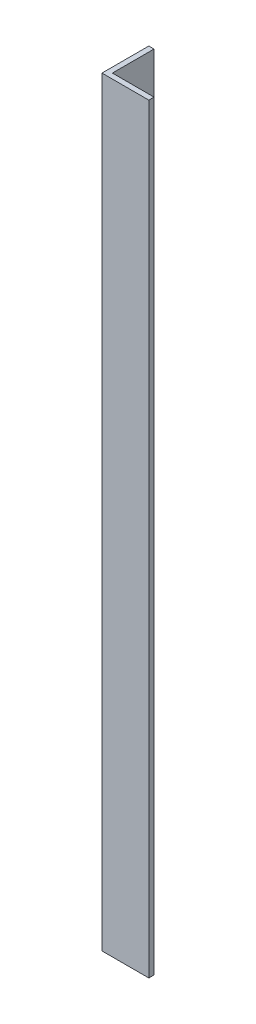
ISO-10303-21;
HEADER;
FILE_DESCRIPTION(('STEP AP214'),'2;1');
FILE_NAME('part.step','',(''),(''),'','','');
FILE_SCHEMA(('AUTOMOTIVE_DESIGN { 1 0 10303 214 1 1 1 1 }'));
ENDSEC;
DATA;
#1=APPLICATION_CONTEXT('core data for automotive mechanical design processes');
#2=APPLICATION_PROTOCOL_DEFINITION('international standard','automotive_design',2000,#1);
#3=PRODUCT_CONTEXT('',#1,'mechanical');
#4=PRODUCT('Part','Part','',(#3));
#5=PRODUCT_RELATED_PRODUCT_CATEGORY('part','',(#4));
#6=PRODUCT_DEFINITION_FORMATION('','',#4);
#7=PRODUCT_DEFINITION_CONTEXT('part definition',#1,'design');
#8=PRODUCT_DEFINITION('design','',#6,#7);
#9=PRODUCT_DEFINITION_SHAPE('','',#8);
#10=(LENGTH_UNIT() NAMED_UNIT(*) SI_UNIT(.MILLI.,.METRE.));
#11=(NAMED_UNIT(*) PLANE_ANGLE_UNIT() SI_UNIT($,.RADIAN.));
#12=(NAMED_UNIT(*) SI_UNIT($,.STERADIAN.) SOLID_ANGLE_UNIT());
#13=UNCERTAINTY_MEASURE_WITH_UNIT(LENGTH_MEASURE(1.E-05),#10,'distance_accuracy_value','');
#14=(GEOMETRIC_REPRESENTATION_CONTEXT(3) GLOBAL_UNCERTAINTY_ASSIGNED_CONTEXT((#13)) GLOBAL_UNIT_ASSIGNED_CONTEXT((#10,
#11,#12)) REPRESENTATION_CONTEXT('',''));
#15=CARTESIAN_POINT('',(0.,0.,0.));
#16=DIRECTION('',(0.,0.,1.));
#17=DIRECTION('',(1.,0.,0.));
#18=AXIS2_PLACEMENT_3D('',#15,#16,#17);
#19=CARTESIAN_POINT('',(0.,730.,0.));
#20=DIRECTION('',(0.,0.,-1.));
#21=DIRECTION('',(-1.,0.,0.));
#22=AXIS2_PLACEMENT_3D('',#19,#20,#21);
#23=PLANE('',#22);
#24=DIRECTION('',(1.,0.,0.));
#25=VECTOR('',#24,1.);
#26=CARTESIAN_POINT('',(0.,0.,0.));
#27=LINE('',#26,#25);
#28=CARTESIAN_POINT('',(0.,0.,0.));
#29=VERTEX_POINT('',#28);
#30=CARTESIAN_POINT('',(45.,0.,0.));
#31=VERTEX_POINT('',#30);
#32=EDGE_CURVE('E138',#29,#31,#27,.T.);
#33=ORIENTED_EDGE('',*,*,#32,.T.);
#34=DIRECTION('',(0.,-1.,0.));
#35=VECTOR('',#34,1.);
#36=CARTESIAN_POINT('',(45.,730.,0.));
#37=LINE('',#36,#35);
#38=CARTESIAN_POINT('',(45.,730.,0.));
#39=VERTEX_POINT('',#38);
#40=EDGE_CURVE('E11',#39,#31,#37,.T.);
#41=ORIENTED_EDGE('',*,*,#40,.F.);
#42=DIRECTION('',(1.,0.,0.));
#43=VECTOR('',#42,1.);
#44=CARTESIAN_POINT('',(0.,730.,0.));
#45=LINE('',#44,#43);
#46=CARTESIAN_POINT('',(0.,730.,0.));
#47=VERTEX_POINT('',#46);
#48=EDGE_CURVE('E97',#47,#39,#45,.T.);
#49=ORIENTED_EDGE('',*,*,#48,.F.);
#50=DIRECTION('',(0.,-1.,0.));
#51=VECTOR('',#50,1.);
#52=CARTESIAN_POINT('',(0.,730.,0.));
#53=LINE('',#52,#51);
#54=EDGE_CURVE('E134',#47,#29,#53,.T.);
#55=ORIENTED_EDGE('',*,*,#54,.T.);
#56=EDGE_LOOP('',(#33,#41,#49,#55));
#57=FACE_BOUND('',#56,.T.);
#58=ADVANCED_FACE('F38',(#57),#23,.F.);
#59=CARTESIAN_POINT('',(45.,730.,-5.));
#60=DIRECTION('',(1.,0.,0.));
#61=DIRECTION('',(0.,0.,-1.));
#62=AXIS2_PLACEMENT_3D('',#59,#60,#61);
#63=PLANE('',#62);
#64=DIRECTION('',(0.,0.,1.));
#65=VECTOR('',#64,1.);
#66=CARTESIAN_POINT('',(45.,0.,-5.));
#67=LINE('',#66,#65);
#68=CARTESIAN_POINT('',(45.,0.,-5.));
#69=VERTEX_POINT('',#68);
#70=EDGE_CURVE('E141',#69,#31,#67,.T.);
#71=ORIENTED_EDGE('',*,*,#70,.F.);
#72=DIRECTION('',(0.,-1.,0.));
#73=VECTOR('',#72,1.);
#74=CARTESIAN_POINT('',(45.,730.,-5.));
#75=LINE('',#74,#73);
#76=CARTESIAN_POINT('',(45.,730.,-5.));
#77=VERTEX_POINT('',#76);
#78=EDGE_CURVE('E47',#77,#69,#75,.T.);
#79=ORIENTED_EDGE('',*,*,#78,.F.);
#80=DIRECTION('',(0.,0.,1.));
#81=VECTOR('',#80,1.);
#82=CARTESIAN_POINT('',(45.,730.,-5.));
#83=LINE('',#82,#81);
#84=EDGE_CURVE('E242',#77,#39,#83,.T.);
#85=ORIENTED_EDGE('',*,*,#84,.T.);
#86=ORIENTED_EDGE('',*,*,#40,.T.);
#87=EDGE_LOOP('',(#71,#79,#85,#86));
#88=FACE_BOUND('',#87,.T.);
#89=ADVANCED_FACE('F168',(#88),#63,.T.);
#90=CARTESIAN_POINT('',(0.,730.,-5.));
#91=DIRECTION('',(0.,0.,-1.));
#92=DIRECTION('',(-1.,0.,0.));
#93=AXIS2_PLACEMENT_3D('',#90,#91,#92);
#94=PLANE('',#93);
#95=DIRECTION('',(1.,0.,0.));
#96=VECTOR('',#95,1.);
#97=CARTESIAN_POINT('',(0.,0.,-5.));
#98=LINE('',#97,#96);
#99=CARTESIAN_POINT('',(5.,0.,-5.));
#100=VERTEX_POINT('',#99);
#101=EDGE_CURVE('E145',#100,#69,#98,.T.);
#102=ORIENTED_EDGE('',*,*,#101,.F.);
#103=DIRECTION('',(0.,-1.,0.));
#104=VECTOR('',#103,1.);
#105=CARTESIAN_POINT('',(5.,730.,-5.));
#106=LINE('',#105,#104);
#107=CARTESIAN_POINT('',(5.,730.,-5.));
#108=VERTEX_POINT('',#107);
#109=EDGE_CURVE('E119',#108,#100,#106,.T.);
#110=ORIENTED_EDGE('',*,*,#109,.F.);
#111=DIRECTION('',(1.,0.,0.));
#112=VECTOR('',#111,1.);
#113=CARTESIAN_POINT('',(0.,730.,-5.));
#114=LINE('',#113,#112);
#115=EDGE_CURVE('E125',#108,#77,#114,.T.);
#116=ORIENTED_EDGE('',*,*,#115,.T.);
#117=ORIENTED_EDGE('',*,*,#78,.T.);
#118=EDGE_LOOP('',(#102,#110,#116,#117));
#119=FACE_BOUND('',#118,.T.);
#120=ADVANCED_FACE('F165',(#119),#94,.T.);
#121=CARTESIAN_POINT('',(5.,730.,-45.));
#122=DIRECTION('',(1.,0.,0.));
#123=DIRECTION('',(0.,0.,-1.));
#124=AXIS2_PLACEMENT_3D('',#121,#122,#123);
#125=PLANE('',#124);
#126=DIRECTION('',(0.,0.,1.));
#127=VECTOR('',#126,1.);
#128=CARTESIAN_POINT('',(5.,0.,-45.));
#129=LINE('',#128,#127);
#130=CARTESIAN_POINT('',(5.,0.,-45.));
#131=VERTEX_POINT('',#130);
#132=EDGE_CURVE('E113',#131,#100,#129,.T.);
#133=ORIENTED_EDGE('',*,*,#132,.F.);
#134=DIRECTION('',(0.,-1.,0.));
#135=VECTOR('',#134,1.);
#136=CARTESIAN_POINT('',(5.,730.,-45.));
#137=LINE('',#136,#135);
#138=CARTESIAN_POINT('',(5.,730.,-45.));
#139=VERTEX_POINT('',#138);
#140=EDGE_CURVE('E108',#139,#131,#137,.T.);
#141=ORIENTED_EDGE('',*,*,#140,.F.);
#142=DIRECTION('',(0.,0.,1.));
#143=VECTOR('',#142,1.);
#144=CARTESIAN_POINT('',(5.,730.,-45.));
#145=LINE('',#144,#143);
#146=EDGE_CURVE('E111',#139,#108,#145,.T.);
#147=ORIENTED_EDGE('',*,*,#146,.T.);
#148=ORIENTED_EDGE('',*,*,#109,.T.);
#149=EDGE_LOOP('',(#133,#141,#147,#148));
#150=FACE_BOUND('',#149,.T.);
#151=ADVANCED_FACE('F110',(#150),#125,.T.);
#152=CARTESIAN_POINT('',(0.,730.,-45.));
#153=DIRECTION('',(0.,0.,-1.));
#154=DIRECTION('',(-1.,0.,0.));
#155=AXIS2_PLACEMENT_3D('',#152,#153,#154);
#156=PLANE('',#155);
#157=DIRECTION('',(1.,0.,0.));
#158=VECTOR('',#157,1.);
#159=CARTESIAN_POINT('',(0.,0.,-45.));
#160=LINE('',#159,#158);
#161=CARTESIAN_POINT('',(0.,0.,-45.));
#162=VERTEX_POINT('',#161);
#163=EDGE_CURVE('E151',#162,#131,#160,.T.);
#164=ORIENTED_EDGE('',*,*,#163,.F.);
#165=DIRECTION('',(0.,-1.,0.));
#166=VECTOR('',#165,1.);
#167=CARTESIAN_POINT('',(0.,730.,-45.));
#168=LINE('',#167,#166);
#169=CARTESIAN_POINT('',(0.,730.,-45.));
#170=VERTEX_POINT('',#169);
#171=EDGE_CURVE('E85',#170,#162,#168,.T.);
#172=ORIENTED_EDGE('',*,*,#171,.F.);
#173=DIRECTION('',(1.,0.,0.));
#174=VECTOR('',#173,1.);
#175=CARTESIAN_POINT('',(0.,730.,-45.));
#176=LINE('',#175,#174);
#177=EDGE_CURVE('E123',#170,#139,#176,.T.);
#178=ORIENTED_EDGE('',*,*,#177,.T.);
#179=ORIENTED_EDGE('',*,*,#140,.T.);
#180=EDGE_LOOP('',(#164,#172,#178,#179));
#181=FACE_BOUND('',#180,.T.);
#182=ADVANCED_FACE('F128',(#181),#156,.T.);
#183=CARTESIAN_POINT('',(0.,730.,-45.));
#184=DIRECTION('',(1.,0.,0.));
#185=DIRECTION('',(0.,0.,-1.));
#186=AXIS2_PLACEMENT_3D('',#183,#184,#185);
#187=PLANE('',#186);
#188=DIRECTION('',(0.,0.,1.));
#189=VECTOR('',#188,1.);
#190=CARTESIAN_POINT('',(0.,0.,-45.));
#191=LINE('',#190,#189);
#192=EDGE_CURVE('E89',#162,#29,#191,.T.);
#193=ORIENTED_EDGE('',*,*,#192,.T.);
#194=ORIENTED_EDGE('',*,*,#54,.F.);
#195=DIRECTION('',(0.,0.,1.));
#196=VECTOR('',#195,1.);
#197=CARTESIAN_POINT('',(0.,730.,-45.));
#198=LINE('',#197,#196);
#199=EDGE_CURVE('E58',#170,#47,#198,.T.);
#200=ORIENTED_EDGE('',*,*,#199,.F.);
#201=ORIENTED_EDGE('',*,*,#171,.T.);
#202=EDGE_LOOP('',(#193,#194,#200,#201));
#203=FACE_BOUND('',#202,.T.);
#204=ADVANCED_FACE('F173',(#203),#187,.F.);
#205=CARTESIAN_POINT('',(0.,730.,0.));
#206=DIRECTION('',(0.,-1.,0.));
#207=DIRECTION('',(-1.,0.,0.));
#208=AXIS2_PLACEMENT_3D('',#205,#206,#207);
#209=PLANE('',#208);
#210=ORIENTED_EDGE('',*,*,#48,.T.);
#211=ORIENTED_EDGE('',*,*,#84,.F.);
#212=ORIENTED_EDGE('',*,*,#115,.F.);
#213=ORIENTED_EDGE('',*,*,#146,.F.);
#214=ORIENTED_EDGE('',*,*,#177,.F.);
#215=ORIENTED_EDGE('',*,*,#199,.T.);
#216=EDGE_LOOP('',(#210,#211,#212,#213,#214,#215));
#217=FACE_BOUND('',#216,.T.);
#218=ADVANCED_FACE('F122',(#217),#209,.F.);
#219=CARTESIAN_POINT('',(0.,0.,0.));
#220=DIRECTION('',(0.,-1.,0.));
#221=DIRECTION('',(-1.,0.,0.));
#222=AXIS2_PLACEMENT_3D('',#219,#220,#221);
#223=PLANE('',#222);
#224=ORIENTED_EDGE('',*,*,#32,.F.);
#225=ORIENTED_EDGE('',*,*,#192,.F.);
#226=ORIENTED_EDGE('',*,*,#163,.T.);
#227=ORIENTED_EDGE('',*,*,#132,.T.);
#228=ORIENTED_EDGE('',*,*,#101,.T.);
#229=ORIENTED_EDGE('',*,*,#70,.T.);
#230=EDGE_LOOP('',(#224,#225,#226,#227,#228,#229));
#231=FACE_BOUND('',#230,.T.);
#232=ADVANCED_FACE('F171',(#231),#223,.T.);
#233=CLOSED_SHELL('',(#58,#89,#120,#151,#182,#204,#218,#232));
#234=MANIFOLD_SOLID_BREP('B2',#233);
#235=ADVANCED_BREP_SHAPE_REPRESENTATION('',(#18,#234),#14);
#236=SHAPE_DEFINITION_REPRESENTATION(#9,#235);
ENDSEC;
END-ISO-10303-21;
